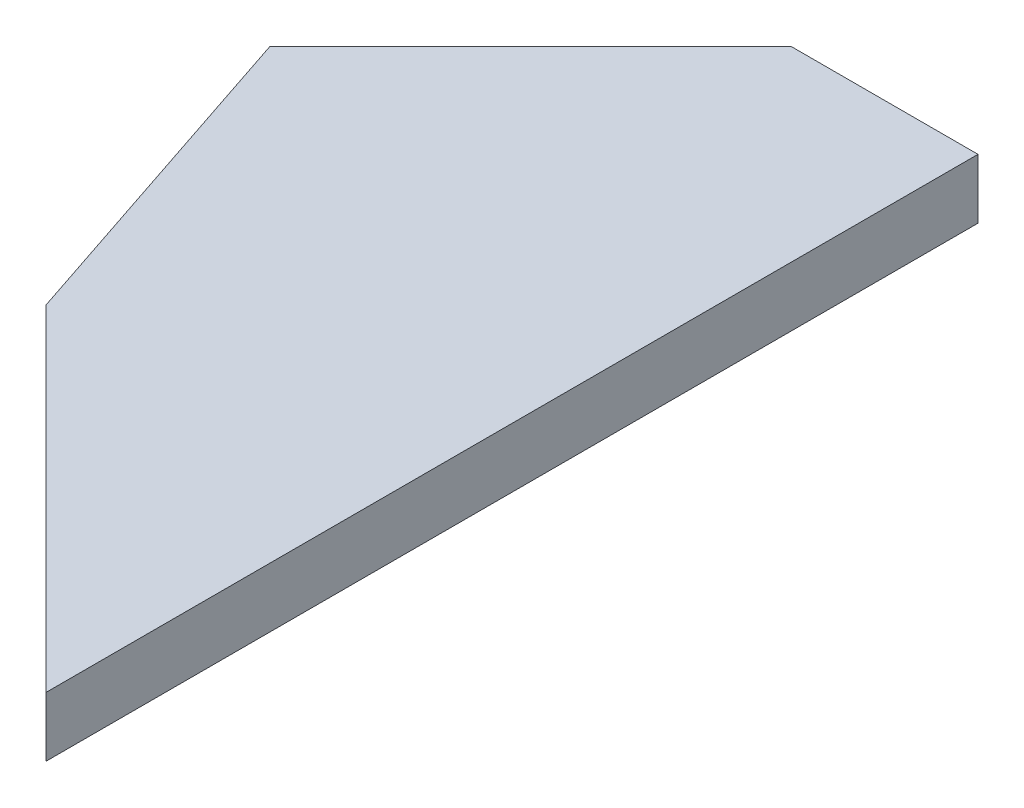
ISO-10303-21;
HEADER;
FILE_DESCRIPTION(('STEP AP214'),'2;1');
FILE_NAME('part.step','',(''),(''),'','','');
FILE_SCHEMA(('AUTOMOTIVE_DESIGN { 1 0 10303 214 1 1 1 1 }'));
ENDSEC;
DATA;
#1=APPLICATION_CONTEXT('core data for automotive mechanical design processes');
#2=APPLICATION_PROTOCOL_DEFINITION('international standard','automotive_design',2000,#1);
#3=PRODUCT_CONTEXT('',#1,'mechanical');
#4=PRODUCT('Part','Part','',(#3));
#5=PRODUCT_RELATED_PRODUCT_CATEGORY('part','',(#4));
#6=PRODUCT_DEFINITION_FORMATION('','',#4);
#7=PRODUCT_DEFINITION_CONTEXT('part definition',#1,'design');
#8=PRODUCT_DEFINITION('design','',#6,#7);
#9=PRODUCT_DEFINITION_SHAPE('','',#8);
#10=(LENGTH_UNIT() NAMED_UNIT(*) SI_UNIT(.MILLI.,.METRE.));
#11=(NAMED_UNIT(*) PLANE_ANGLE_UNIT() SI_UNIT($,.RADIAN.));
#12=(NAMED_UNIT(*) SI_UNIT($,.STERADIAN.) SOLID_ANGLE_UNIT());
#13=UNCERTAINTY_MEASURE_WITH_UNIT(LENGTH_MEASURE(1.E-05),#10,'distance_accuracy_value','');
#14=(GEOMETRIC_REPRESENTATION_CONTEXT(3) GLOBAL_UNCERTAINTY_ASSIGNED_CONTEXT((#13)) GLOBAL_UNIT_ASSIGNED_CONTEXT((#10,
#11,#12)) REPRESENTATION_CONTEXT('',''));
#15=CARTESIAN_POINT('',(0.,0.,0.));
#16=DIRECTION('',(0.,0.,1.));
#17=DIRECTION('',(1.,0.,0.));
#18=AXIS2_PLACEMENT_3D('',#15,#16,#17);
#19=CARTESIAN_POINT('',(0.,0.,0.));
#20=DIRECTION('',(0.,1.,0.));
#21=DIRECTION('',(0.,0.,1.));
#22=AXIS2_PLACEMENT_3D('',#19,#20,#21);
#23=PLANE('',#22);
#24=DIRECTION('',(-0.707106781186548,0.,0.707106781186548));
#25=VECTOR('',#24,1.);
#26=CARTESIAN_POINT('',(-10.,0.,-10.));
#27=LINE('',#26,#25);
#28=CARTESIAN_POINT('',(80.,0.,-100.));
#29=VERTEX_POINT('',#28);
#30=CARTESIAN_POINT('',(52.,0.,-72.));
#31=VERTEX_POINT('',#30);
#32=EDGE_CURVE('E91',#29,#31,#27,.T.);
#33=ORIENTED_EDGE('',*,*,#32,.F.);
#34=DIRECTION('',(-1.,0.,0.));
#35=VECTOR('',#34,1.);
#36=CARTESIAN_POINT('',(0.,0.,-100.));
#37=LINE('',#36,#35);
#38=CARTESIAN_POINT('',(100.,0.,-100.));
#39=VERTEX_POINT('',#38);
#40=EDGE_CURVE('E86',#39,#29,#37,.T.);
#41=ORIENTED_EDGE('',*,*,#40,.F.);
#42=DIRECTION('',(0.,0.,1.));
#43=VECTOR('',#42,1.);
#44=CARTESIAN_POINT('',(100.,0.,0.));
#45=LINE('',#44,#43);
#46=CARTESIAN_POINT('',(100.,0.,0.));
#47=VERTEX_POINT('',#46);
#48=EDGE_CURVE('E75',#39,#47,#45,.T.);
#49=ORIENTED_EDGE('',*,*,#48,.T.);
#50=DIRECTION('',(-0.707106781186546,0.,-0.707106781186549));
#51=VECTOR('',#50,1.);
#52=CARTESIAN_POINT('',(50.0000000000002,0.,-50.));
#53=LINE('',#52,#51);
#54=CARTESIAN_POINT('',(64.0000000000001,0.,-36.));
#55=VERTEX_POINT('',#54);
#56=EDGE_CURVE('E62',#47,#55,#53,.T.);
#57=ORIENTED_EDGE('',*,*,#56,.T.);
#58=DIRECTION('',(0.316227766016841,0.,0.948683298050513));
#59=VECTOR('',#58,1.);
#60=CARTESIAN_POINT('',(68.4000000000001,0.,-22.8000000000003));
#61=LINE('',#60,#59);
#62=EDGE_CURVE('E20',#31,#55,#61,.T.);
#63=ORIENTED_EDGE('',*,*,#62,.F.);
#64=EDGE_LOOP('',(#33,#41,#49,#57,#63));
#65=FACE_BOUND('',#64,.T.);
#66=ADVANCED_FACE('F17',(#65),#23,.F.);
#67=CARTESIAN_POINT('',(68.4000000000001,6.4,-22.8000000000003));
#68=DIRECTION('',(-0.948683298050513,0.,0.316227766016841));
#69=DIRECTION('',(0.316227766016841,0.,0.948683298050513));
#70=AXIS2_PLACEMENT_3D('',#67,#68,#69);
#71=PLANE('',#70);
#72=DIRECTION('',(0.316227766016841,0.,0.948683298050512));
#73=VECTOR('',#72,1.);
#74=CARTESIAN_POINT('',(52.,6.4,-72.));
#75=LINE('',#74,#73);
#76=CARTESIAN_POINT('',(52.,6.4,-72.));
#77=VERTEX_POINT('',#76);
#78=CARTESIAN_POINT('',(64.0000000000001,6.4,-36.));
#79=VERTEX_POINT('',#78);
#80=EDGE_CURVE('E95',#77,#79,#75,.T.);
#81=ORIENTED_EDGE('',*,*,#80,.F.);
#82=DIRECTION('',(0.,1.,0.));
#83=VECTOR('',#82,1.);
#84=CARTESIAN_POINT('',(52.,6.4,-72.));
#85=LINE('',#84,#83);
#86=EDGE_CURVE('E71',#31,#77,#85,.T.);
#87=ORIENTED_EDGE('',*,*,#86,.F.);
#88=ORIENTED_EDGE('',*,*,#62,.T.);
#89=DIRECTION('',(0.,1.,0.));
#90=VECTOR('',#89,1.);
#91=CARTESIAN_POINT('',(64.0000000000001,6.4,-36.));
#92=LINE('',#91,#90);
#93=EDGE_CURVE('E68',#55,#79,#92,.T.);
#94=ORIENTED_EDGE('',*,*,#93,.T.);
#95=EDGE_LOOP('',(#81,#87,#88,#94));
#96=FACE_BOUND('',#95,.T.);
#97=ADVANCED_FACE('F67',(#96),#71,.T.);
#98=CARTESIAN_POINT('',(50.0000000000002,6.4,-50.));
#99=DIRECTION('',(0.707106781186549,0.,-0.707106781186546));
#100=DIRECTION('',(-0.707106781186546,0.,-0.707106781186549));
#101=AXIS2_PLACEMENT_3D('',#98,#99,#100);
#102=PLANE('',#101);
#103=DIRECTION('',(0.,1.,0.));
#104=VECTOR('',#103,1.);
#105=CARTESIAN_POINT('',(100.,6.4,0.));
#106=LINE('',#105,#104);
#107=CARTESIAN_POINT('',(100.,6.4,0.));
#108=VERTEX_POINT('',#107);
#109=EDGE_CURVE('E77',#47,#108,#106,.T.);
#110=ORIENTED_EDGE('',*,*,#109,.T.);
#111=DIRECTION('',(0.707106781186546,0.,0.707106781186549));
#112=VECTOR('',#111,1.);
#113=CARTESIAN_POINT('',(64.0000000000001,6.4,-36.));
#114=LINE('',#113,#112);
#115=EDGE_CURVE('E81',#79,#108,#114,.T.);
#116=ORIENTED_EDGE('',*,*,#115,.F.);
#117=ORIENTED_EDGE('',*,*,#93,.F.);
#118=ORIENTED_EDGE('',*,*,#56,.F.);
#119=EDGE_LOOP('',(#110,#116,#117,#118));
#120=FACE_BOUND('',#119,.T.);
#121=ADVANCED_FACE('F79',(#120),#102,.F.);
#122=CARTESIAN_POINT('',(100.,6.4,0.));
#123=DIRECTION('',(-1.,0.,0.));
#124=DIRECTION('',(0.,0.,1.));
#125=AXIS2_PLACEMENT_3D('',#122,#123,#124);
#126=PLANE('',#125);
#127=DIRECTION('',(0.,1.,0.));
#128=VECTOR('',#127,1.);
#129=CARTESIAN_POINT('',(100.,6.4,-100.));
#130=LINE('',#129,#128);
#131=CARTESIAN_POINT('',(100.,6.4,-100.));
#132=VERTEX_POINT('',#131);
#133=EDGE_CURVE('E88',#132,#39,#130,.F.);
#134=ORIENTED_EDGE('',*,*,#133,.F.);
#135=DIRECTION('',(0.,0.,1.));
#136=VECTOR('',#135,1.);
#137=CARTESIAN_POINT('',(100.,6.4,0.));
#138=LINE('',#137,#136);
#139=EDGE_CURVE('E98',#108,#132,#138,.F.);
#140=ORIENTED_EDGE('',*,*,#139,.F.);
#141=ORIENTED_EDGE('',*,*,#109,.F.);
#142=ORIENTED_EDGE('',*,*,#48,.F.);
#143=EDGE_LOOP('',(#134,#140,#141,#142));
#144=FACE_BOUND('',#143,.T.);
#145=ADVANCED_FACE('F107',(#144),#126,.F.);
#146=CARTESIAN_POINT('',(0.,6.4,-100.));
#147=DIRECTION('',(0.,0.,-1.));
#148=DIRECTION('',(-1.,0.,0.));
#149=AXIS2_PLACEMENT_3D('',#146,#147,#148);
#150=PLANE('',#149);
#151=DIRECTION('',(1.,0.,0.));
#152=VECTOR('',#151,1.);
#153=CARTESIAN_POINT('',(0.,6.4,-100.));
#154=LINE('',#153,#152);
#155=CARTESIAN_POINT('',(80.,6.4,-100.));
#156=VERTEX_POINT('',#155);
#157=EDGE_CURVE('E26',#132,#156,#154,.F.);
#158=ORIENTED_EDGE('',*,*,#157,.F.);
#159=ORIENTED_EDGE('',*,*,#133,.T.);
#160=ORIENTED_EDGE('',*,*,#40,.T.);
#161=DIRECTION('',(0.,1.,0.));
#162=VECTOR('',#161,1.);
#163=CARTESIAN_POINT('',(80.,6.4,-100.));
#164=LINE('',#163,#162);
#165=EDGE_CURVE('E35',#156,#29,#164,.F.);
#166=ORIENTED_EDGE('',*,*,#165,.F.);
#167=EDGE_LOOP('',(#158,#159,#160,#166));
#168=FACE_BOUND('',#167,.T.);
#169=ADVANCED_FACE('F105',(#168),#150,.T.);
#170=CARTESIAN_POINT('',(-10.,6.4,-10.));
#171=DIRECTION('',(-0.707106781186548,0.,-0.707106781186548));
#172=DIRECTION('',(-0.707106781186548,0.,0.707106781186548));
#173=AXIS2_PLACEMENT_3D('',#170,#171,#172);
#174=PLANE('',#173);
#175=DIRECTION('',(-0.707106781186548,0.,0.707106781186547));
#176=VECTOR('',#175,1.);
#177=CARTESIAN_POINT('',(80.,6.4,-100.));
#178=LINE('',#177,#176);
#179=EDGE_CURVE('E11',#156,#77,#178,.T.);
#180=ORIENTED_EDGE('',*,*,#179,.F.);
#181=ORIENTED_EDGE('',*,*,#165,.T.);
#182=ORIENTED_EDGE('',*,*,#32,.T.);
#183=ORIENTED_EDGE('',*,*,#86,.T.);
#184=EDGE_LOOP('',(#180,#181,#182,#183));
#185=FACE_BOUND('',#184,.T.);
#186=ADVANCED_FACE('F109',(#185),#174,.T.);
#187=CARTESIAN_POINT('',(0.,6.4,0.));
#188=DIRECTION('',(0.,1.,0.));
#189=DIRECTION('',(0.,0.,1.));
#190=AXIS2_PLACEMENT_3D('',#187,#188,#189);
#191=PLANE('',#190);
#192=ORIENTED_EDGE('',*,*,#157,.T.);
#193=ORIENTED_EDGE('',*,*,#179,.T.);
#194=ORIENTED_EDGE('',*,*,#80,.T.);
#195=ORIENTED_EDGE('',*,*,#115,.T.);
#196=ORIENTED_EDGE('',*,*,#139,.T.);
#197=EDGE_LOOP('',(#192,#193,#194,#195,#196));
#198=FACE_BOUND('',#197,.T.);
#199=ADVANCED_FACE('F103',(#198),#191,.T.);
#200=CLOSED_SHELL('',(#66,#97,#121,#145,#169,#186,#199));
#201=MANIFOLD_SOLID_BREP('B1',#200);
#202=ADVANCED_BREP_SHAPE_REPRESENTATION('',(#18,#201),#14);
#203=SHAPE_DEFINITION_REPRESENTATION(#9,#202);
ENDSEC;
END-ISO-10303-21;
